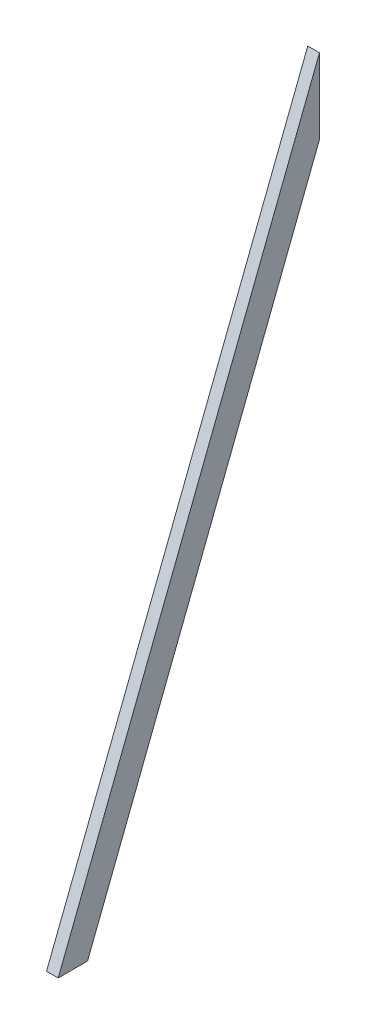
ISO-10303-21;
HEADER;
FILE_DESCRIPTION(('STEP AP214'),'2;1');
FILE_NAME('part.step','',(''),(''),'','','');
FILE_SCHEMA(('AUTOMOTIVE_DESIGN { 1 0 10303 214 1 1 1 1 }'));
ENDSEC;
DATA;
#1=APPLICATION_CONTEXT('core data for automotive mechanical design processes');
#2=APPLICATION_PROTOCOL_DEFINITION('international standard','automotive_design',2000,#1);
#3=PRODUCT_CONTEXT('',#1,'mechanical');
#4=PRODUCT('Part','Part','',(#3));
#5=PRODUCT_RELATED_PRODUCT_CATEGORY('part','',(#4));
#6=PRODUCT_DEFINITION_FORMATION('','',#4);
#7=PRODUCT_DEFINITION_CONTEXT('part definition',#1,'design');
#8=PRODUCT_DEFINITION('design','',#6,#7);
#9=PRODUCT_DEFINITION_SHAPE('','',#8);
#10=(LENGTH_UNIT() NAMED_UNIT(*) SI_UNIT(.MILLI.,.METRE.));
#11=(NAMED_UNIT(*) PLANE_ANGLE_UNIT() SI_UNIT($,.RADIAN.));
#12=(NAMED_UNIT(*) SI_UNIT($,.STERADIAN.) SOLID_ANGLE_UNIT());
#13=UNCERTAINTY_MEASURE_WITH_UNIT(LENGTH_MEASURE(1.E-05),#10,'distance_accuracy_value','');
#14=(GEOMETRIC_REPRESENTATION_CONTEXT(3) GLOBAL_UNCERTAINTY_ASSIGNED_CONTEXT((#13)) GLOBAL_UNIT_ASSIGNED_CONTEXT((#10,
#11,#12)) REPRESENTATION_CONTEXT('',''));
#15=CARTESIAN_POINT('',(0.,0.,0.));
#16=DIRECTION('',(0.,0.,1.));
#17=DIRECTION('',(1.,0.,0.));
#18=AXIS2_PLACEMENT_3D('',#15,#16,#17);
#19=CARTESIAN_POINT('',(38.1,-1092.2,425.45));
#20=DIRECTION('',(0.,-0.36296906780681,-0.931801188996588));
#21=DIRECTION('',(0.,0.931801188996588,-0.36296906780681));
#22=AXIS2_PLACEMENT_3D('',#19,#20,#21);
#23=PLANE('',#22);
#24=DIRECTION('',(0.,-0.931801188996588,0.36296906780681));
#25=VECTOR('',#24,1.);
#26=CARTESIAN_POINT('',(0.,-1092.2,425.45));
#27=LINE('',#26,#25);
#28=CARTESIAN_POINT('',(0.,1092.2,-425.45));
#29=VERTEX_POINT('',#28);
#30=CARTESIAN_POINT('',(0.,-1092.2,425.45));
#31=VERTEX_POINT('',#30);
#32=EDGE_CURVE('E98',#29,#31,#27,.T.);
#33=ORIENTED_EDGE('',*,*,#32,.T.);
#34=DIRECTION('',(-1.,0.,0.));
#35=VECTOR('',#34,1.);
#36=CARTESIAN_POINT('',(38.1,-1092.2,425.45));
#37=LINE('',#36,#35);
#38=CARTESIAN_POINT('',(38.1,-1092.2,425.45));
#39=VERTEX_POINT('',#38);
#40=EDGE_CURVE('E11',#39,#31,#37,.T.);
#41=ORIENTED_EDGE('',*,*,#40,.F.);
#42=DIRECTION('',(0.,-0.931801188996588,0.36296906780681));
#43=VECTOR('',#42,1.);
#44=CARTESIAN_POINT('',(38.1,-1092.2,425.45));
#45=LINE('',#44,#43);
#46=CARTESIAN_POINT('',(38.1,1092.2,-425.45));
#47=VERTEX_POINT('',#46);
#48=EDGE_CURVE('E86',#47,#39,#45,.T.);
#49=ORIENTED_EDGE('',*,*,#48,.F.);
#50=DIRECTION('',(-1.,0.,0.));
#51=VECTOR('',#50,1.);
#52=CARTESIAN_POINT('',(38.1,1092.2,-425.45));
#53=LINE('',#52,#51);
#54=EDGE_CURVE('E94',#47,#29,#53,.T.);
#55=ORIENTED_EDGE('',*,*,#54,.T.);
#56=EDGE_LOOP('',(#33,#41,#49,#55));
#57=FACE_BOUND('',#56,.T.);
#58=ADVANCED_FACE('F35',(#57),#23,.F.);
#59=CARTESIAN_POINT('',(38.1,-1092.2,425.45));
#60=DIRECTION('',(0.,1.,0.));
#61=DIRECTION('',(0.,0.,1.));
#62=AXIS2_PLACEMENT_3D('',#59,#60,#61);
#63=PLANE('',#62);
#64=DIRECTION('',(0.,0.,-1.));
#65=VECTOR('',#64,1.);
#66=CARTESIAN_POINT('',(0.,-1092.2,425.45));
#67=LINE('',#66,#65);
#68=CARTESIAN_POINT('',(0.,-1092.2,330.04338209717));
#69=VERTEX_POINT('',#68);
#70=EDGE_CURVE('E90',#31,#69,#67,.T.);
#71=ORIENTED_EDGE('',*,*,#70,.T.);
#72=DIRECTION('',(-1.,0.,0.));
#73=VECTOR('',#72,1.);
#74=CARTESIAN_POINT('',(38.1,-1092.2,330.04338209717));
#75=LINE('',#74,#73);
#76=CARTESIAN_POINT('',(38.1,-1092.2,330.04338209717));
#77=VERTEX_POINT('',#76);
#78=EDGE_CURVE('E43',#77,#69,#75,.T.);
#79=ORIENTED_EDGE('',*,*,#78,.F.);
#80=DIRECTION('',(0.,0.,-1.));
#81=VECTOR('',#80,1.);
#82=CARTESIAN_POINT('',(38.1,-1092.2,425.45));
#83=LINE('',#82,#81);
#84=EDGE_CURVE('E81',#39,#77,#83,.T.);
#85=ORIENTED_EDGE('',*,*,#84,.F.);
#86=ORIENTED_EDGE('',*,*,#40,.T.);
#87=EDGE_LOOP('',(#71,#79,#85,#86));
#88=FACE_BOUND('',#87,.T.);
#89=ADVANCED_FACE('F89',(#88),#63,.F.);
#90=CARTESIAN_POINT('',(38.1,-1092.2,330.04338209717));
#91=DIRECTION('',(0.,0.362969067806811,0.931801188996588));
#92=DIRECTION('',(0.,-0.931801188996588,0.362969067806811));
#93=AXIS2_PLACEMENT_3D('',#90,#91,#92);
#94=PLANE('',#93);
#95=DIRECTION('',(0.,0.931801188996588,-0.36296906780681));
#96=VECTOR('',#95,1.);
#97=CARTESIAN_POINT('',(0.,-1092.2,330.04338209717));
#98=LINE('',#97,#96);
#99=CARTESIAN_POINT('',(0.,847.275548070347,-425.45));
#100=VERTEX_POINT('',#99);
#101=EDGE_CURVE('E68',#69,#100,#98,.T.);
#102=ORIENTED_EDGE('',*,*,#101,.T.);
#103=DIRECTION('',(-1.,0.,0.));
#104=VECTOR('',#103,1.);
#105=CARTESIAN_POINT('',(38.1,847.275548070347,-425.45));
#106=LINE('',#105,#104);
#107=CARTESIAN_POINT('',(38.1,847.275548070347,-425.45));
#108=VERTEX_POINT('',#107);
#109=EDGE_CURVE('E91',#108,#100,#106,.T.);
#110=ORIENTED_EDGE('',*,*,#109,.F.);
#111=DIRECTION('',(0.,0.931801188996588,-0.36296906780681));
#112=VECTOR('',#111,1.);
#113=CARTESIAN_POINT('',(38.1,-1092.2,330.04338209717));
#114=LINE('',#113,#112);
#115=EDGE_CURVE('E84',#77,#108,#114,.T.);
#116=ORIENTED_EDGE('',*,*,#115,.F.);
#117=ORIENTED_EDGE('',*,*,#78,.T.);
#118=EDGE_LOOP('',(#102,#110,#116,#117));
#119=FACE_BOUND('',#118,.T.);
#120=ADVANCED_FACE('F92',(#119),#94,.F.);
#121=CARTESIAN_POINT('',(38.1,847.275548070347,-425.45));
#122=DIRECTION('',(0.,0.,1.));
#123=DIRECTION('',(0.,-1.,0.));
#124=AXIS2_PLACEMENT_3D('',#121,#122,#123);
#125=PLANE('',#124);
#126=DIRECTION('',(0.,1.,0.));
#127=VECTOR('',#126,1.);
#128=CARTESIAN_POINT('',(0.,847.275548070347,-425.45));
#129=LINE('',#128,#127);
#130=EDGE_CURVE('E74',#100,#29,#129,.T.);
#131=ORIENTED_EDGE('',*,*,#130,.T.);
#132=ORIENTED_EDGE('',*,*,#54,.F.);
#133=DIRECTION('',(0.,1.,0.));
#134=VECTOR('',#133,1.);
#135=CARTESIAN_POINT('',(38.1,847.275548070347,-425.45));
#136=LINE('',#135,#134);
#137=EDGE_CURVE('E51',#108,#47,#136,.T.);
#138=ORIENTED_EDGE('',*,*,#137,.F.);
#139=ORIENTED_EDGE('',*,*,#109,.T.);
#140=EDGE_LOOP('',(#131,#132,#138,#139));
#141=FACE_BOUND('',#140,.T.);
#142=ADVANCED_FACE('F105',(#141),#125,.F.);
#143=CARTESIAN_POINT('',(38.1,0.,0.));
#144=DIRECTION('',(-1.,0.,0.));
#145=DIRECTION('',(0.,0.,1.));
#146=AXIS2_PLACEMENT_3D('',#143,#144,#145);
#147=PLANE('',#146);
#148=ORIENTED_EDGE('',*,*,#48,.T.);
#149=ORIENTED_EDGE('',*,*,#84,.T.);
#150=ORIENTED_EDGE('',*,*,#115,.T.);
#151=ORIENTED_EDGE('',*,*,#137,.T.);
#152=EDGE_LOOP('',(#148,#149,#150,#151));
#153=FACE_BOUND('',#152,.T.);
#154=ADVANCED_FACE('F82',(#153),#147,.F.);
#155=CARTESIAN_POINT('',(0.,0.,0.));
#156=DIRECTION('',(-1.,0.,0.));
#157=DIRECTION('',(0.,0.,1.));
#158=AXIS2_PLACEMENT_3D('',#155,#156,#157);
#159=PLANE('',#158);
#160=ORIENTED_EDGE('',*,*,#32,.F.);
#161=ORIENTED_EDGE('',*,*,#130,.F.);
#162=ORIENTED_EDGE('',*,*,#101,.F.);
#163=ORIENTED_EDGE('',*,*,#70,.F.);
#164=EDGE_LOOP('',(#160,#161,#162,#163));
#165=FACE_BOUND('',#164,.T.);
#166=ADVANCED_FACE('F108',(#165),#159,.T.);
#167=CLOSED_SHELL('',(#58,#89,#120,#142,#154,#166));
#168=MANIFOLD_SOLID_BREP('B2',#167);
#169=ADVANCED_BREP_SHAPE_REPRESENTATION('',(#18,#168),#14);
#170=SHAPE_DEFINITION_REPRESENTATION(#9,#169);
ENDSEC;
END-ISO-10303-21;
